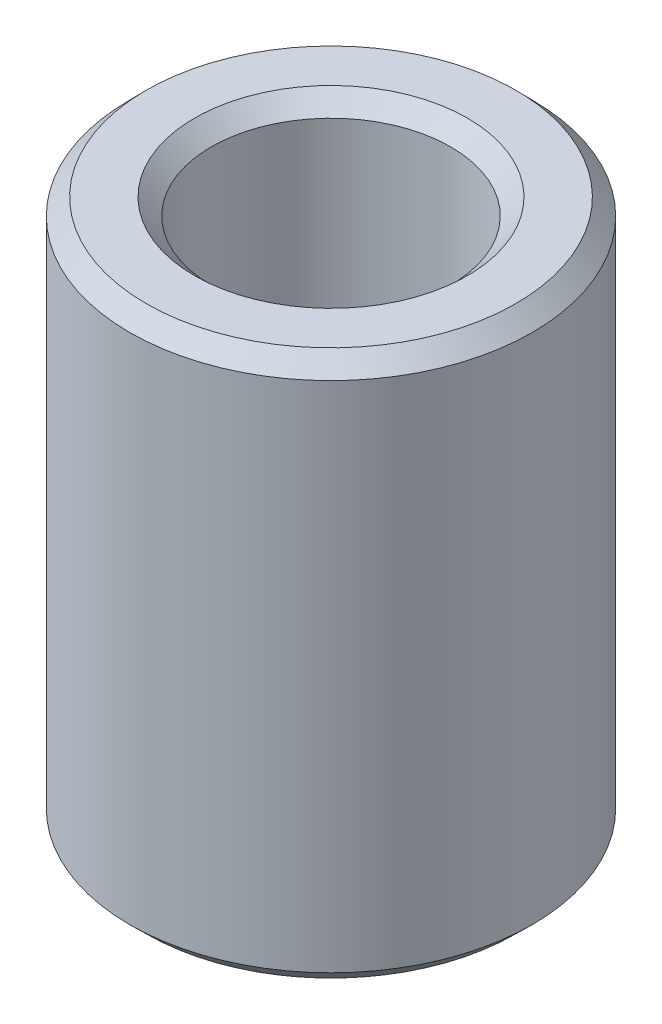
ISO-10303-21;
HEADER;
FILE_DESCRIPTION(('STEP AP214'),'2;1');
FILE_NAME('part.step','',(''),(''),'','','');
FILE_SCHEMA(('AUTOMOTIVE_DESIGN { 1 0 10303 214 1 1 1 1 }'));
ENDSEC;
DATA;
#1=APPLICATION_CONTEXT('core data for automotive mechanical design processes');
#2=APPLICATION_PROTOCOL_DEFINITION('international standard','automotive_design',2000,#1);
#3=PRODUCT_CONTEXT('',#1,'mechanical');
#4=PRODUCT('Part','Part','',(#3));
#5=PRODUCT_RELATED_PRODUCT_CATEGORY('part','',(#4));
#6=PRODUCT_DEFINITION_FORMATION('','',#4);
#7=PRODUCT_DEFINITION_CONTEXT('part definition',#1,'design');
#8=PRODUCT_DEFINITION('design','',#6,#7);
#9=PRODUCT_DEFINITION_SHAPE('','',#8);
#10=(LENGTH_UNIT() NAMED_UNIT(*) SI_UNIT(.MILLI.,.METRE.));
#11=(NAMED_UNIT(*) PLANE_ANGLE_UNIT() SI_UNIT($,.RADIAN.));
#12=(NAMED_UNIT(*) SI_UNIT($,.STERADIAN.) SOLID_ANGLE_UNIT());
#13=UNCERTAINTY_MEASURE_WITH_UNIT(LENGTH_MEASURE(1.E-05),#10,'distance_accuracy_value','');
#14=(GEOMETRIC_REPRESENTATION_CONTEXT(3) GLOBAL_UNCERTAINTY_ASSIGNED_CONTEXT((#13)) GLOBAL_UNIT_ASSIGNED_CONTEXT((#10,
#11,#12)) REPRESENTATION_CONTEXT('',''));
#15=CARTESIAN_POINT('',(0.,0.,0.));
#16=DIRECTION('',(0.,0.,1.));
#17=DIRECTION('',(1.,0.,0.));
#18=AXIS2_PLACEMENT_3D('',#15,#16,#17);
#19=CARTESIAN_POINT('',(0.,33.9073036419088,0.));
#20=DIRECTION('',(0.,-1.,0.));
#21=DIRECTION('',(0.,0.,-1.));
#22=AXIS2_PLACEMENT_3D('',#19,#20,#21);
#23=CYLINDRICAL_SURFACE('',#22,12.5);
#24=CARTESIAN_POINT('',(0.,1.02267454057475,0.));
#25=DIRECTION('',(0.,1.,0.));
#26=DIRECTION('',(0.,0.,1.));
#27=AXIS2_PLACEMENT_3D('',#24,#25,#26);
#28=CIRCLE('',#27,12.5);
#29=CARTESIAN_POINT('',(0.,1.02267454057475,12.5));
#30=VERTEX_POINT('',#29);
#31=EDGE_CURVE('E10',#30,#30,#28,.T.);
#32=ORIENTED_EDGE('',*,*,#31,.T.);
#33=EDGE_LOOP('',(#32));
#34=FACE_BOUND('',#33,.T.);
#35=CARTESIAN_POINT('',(0.,32.8659539406307,0.));
#36=DIRECTION('',(0.,1.,0.));
#37=DIRECTION('',(0.,0.,1.));
#38=AXIS2_PLACEMENT_3D('',#35,#36,#37);
#39=CIRCLE('',#38,12.5);
#40=CARTESIAN_POINT('',(0.,32.8659539406307,12.5));
#41=VERTEX_POINT('',#40);
#42=EDGE_CURVE('E50',#41,#41,#39,.F.);
#43=ORIENTED_EDGE('',*,*,#42,.T.);
#44=EDGE_LOOP('',(#43));
#45=FACE_BOUND('',#44,.T.);
#46=ADVANCED_FACE('F39',(#34,#45),#23,.T.);
#47=CARTESIAN_POINT('',(0.,33.9073036419088,0.));
#48=DIRECTION('',(0.,1.,0.));
#49=DIRECTION('',(0.,0.,1.));
#50=AXIS2_PLACEMENT_3D('',#47,#48,#49);
#51=PLANE('',#50);
#52=CARTESIAN_POINT('',(0.,33.9073036419088,0.));
#53=DIRECTION('',(0.,1.,0.));
#54=DIRECTION('',(0.,0.,1.));
#55=AXIS2_PLACEMENT_3D('',#52,#53,#54);
#56=CIRCLE('',#55,8.47496577175573);
#57=CARTESIAN_POINT('',(0.,33.9073036419088,8.47496577175573));
#58=VERTEX_POINT('',#57);
#59=EDGE_CURVE('E58',#58,#58,#56,.F.);
#60=ORIENTED_EDGE('',*,*,#59,.T.);
#61=EDGE_LOOP('',(#60));
#62=FACE_BOUND('',#61,.T.);
#63=CARTESIAN_POINT('',(0.,33.9073036419088,0.));
#64=DIRECTION('',(0.,1.,0.));
#65=DIRECTION('',(0.,0.,1.));
#66=AXIS2_PLACEMENT_3D('',#63,#64,#65);
#67=CIRCLE('',#66,11.4773254594253);
#68=CARTESIAN_POINT('',(0.,33.9073036419088,11.4773254594253));
#69=VERTEX_POINT('',#68);
#70=EDGE_CURVE('E61',#69,#69,#67,.T.);
#71=ORIENTED_EDGE('',*,*,#70,.T.);
#72=EDGE_LOOP('',(#71));
#73=FACE_BOUND('',#72,.T.);
#74=ADVANCED_FACE('F88',(#62,#73),#51,.T.);
#75=CARTESIAN_POINT('',(0.,0.,0.));
#76=DIRECTION('',(0.,1.,0.));
#77=DIRECTION('',(0.,0.,1.));
#78=AXIS2_PLACEMENT_3D('',#75,#76,#77);
#79=PLANE('',#78);
#80=CARTESIAN_POINT('',(0.,0.,0.));
#81=DIRECTION('',(0.,1.,0.));
#82=DIRECTION('',(0.,0.,1.));
#83=AXIS2_PLACEMENT_3D('',#80,#81,#82);
#84=CIRCLE('',#83,8.45629061105244);
#85=CARTESIAN_POINT('',(0.,0.,8.45629061105244));
#86=VERTEX_POINT('',#85);
#87=EDGE_CURVE('E51',#86,#86,#84,.T.);
#88=ORIENTED_EDGE('',*,*,#87,.T.);
#89=EDGE_LOOP('',(#88));
#90=FACE_BOUND('',#89,.T.);
#91=CARTESIAN_POINT('',(0.,0.,0.));
#92=DIRECTION('',(0.,1.,0.));
#93=DIRECTION('',(0.,0.,1.));
#94=AXIS2_PLACEMENT_3D('',#91,#92,#93);
#95=CIRCLE('',#94,11.458650298722);
#96=CARTESIAN_POINT('',(0.,0.,11.458650298722));
#97=VERTEX_POINT('',#96);
#98=EDGE_CURVE('E54',#97,#97,#95,.F.);
#99=ORIENTED_EDGE('',*,*,#98,.T.);
#100=EDGE_LOOP('',(#99));
#101=FACE_BOUND('',#100,.T.);
#102=ADVANCED_FACE('F83',(#90,#101),#79,.F.);
#103=CARTESIAN_POINT('',(0.,33.9073036419088,0.));
#104=DIRECTION('',(0.,-1.,0.));
#105=DIRECTION('',(0.,0.,-1.));
#106=AXIS2_PLACEMENT_3D('',#103,#104,#105);
#107=CYLINDRICAL_SURFACE('',#106,7.43361607047769);
#108=CARTESIAN_POINT('',(0.,32.884629101334,0.));
#109=DIRECTION('',(0.,1.,0.));
#110=DIRECTION('',(0.,0.,1.));
#111=AXIS2_PLACEMENT_3D('',#108,#109,#110);
#112=CIRCLE('',#111,7.43361607047769);
#113=CARTESIAN_POINT('',(0.,32.884629101334,7.43361607047769));
#114=VERTEX_POINT('',#113);
#115=EDGE_CURVE('E67',#114,#114,#112,.T.);
#116=ORIENTED_EDGE('',*,*,#115,.T.);
#117=EDGE_LOOP('',(#116));
#118=FACE_BOUND('',#117,.T.);
#119=CARTESIAN_POINT('',(0.,1.04134970127803,0.));
#120=DIRECTION('',(0.,1.,0.));
#121=DIRECTION('',(0.,0.,1.));
#122=AXIS2_PLACEMENT_3D('',#119,#120,#121);
#123=CIRCLE('',#122,7.43361607047769);
#124=CARTESIAN_POINT('',(0.,1.04134970127803,7.43361607047769));
#125=VERTEX_POINT('',#124);
#126=EDGE_CURVE('E69',#125,#125,#123,.F.);
#127=ORIENTED_EDGE('',*,*,#126,.T.);
#128=EDGE_LOOP('',(#127));
#129=FACE_BOUND('',#128,.T.);
#130=ADVANCED_FACE('F71',(#118,#129),#107,.F.);
#131=CARTESIAN_POINT('',(0.,32.884629101334,0.));
#132=DIRECTION('',(0.,1.,0.));
#133=DIRECTION('',(0.,0.,1.));
#134=AXIS2_PLACEMENT_3D('',#131,#132,#133);
#135=CONICAL_SURFACE('',#134,7.43361607047769,0.794445853213613);
#136=ORIENTED_EDGE('',*,*,#59,.F.);
#137=EDGE_LOOP('',(#136));
#138=FACE_BOUND('',#137,.T.);
#139=ORIENTED_EDGE('',*,*,#115,.F.);
#140=EDGE_LOOP('',(#139));
#141=FACE_BOUND('',#140,.T.);
#142=ADVANCED_FACE('F77',(#138,#141),#135,.F.);
#143=CARTESIAN_POINT('',(0.,0.,0.));
#144=DIRECTION('',(0.,-1.,0.));
#145=DIRECTION('',(0.,0.,-1.));
#146=AXIS2_PLACEMENT_3D('',#143,#144,#145);
#147=CONICAL_SURFACE('',#146,8.45629061105244,0.776350473581289);
#148=ORIENTED_EDGE('',*,*,#126,.F.);
#149=EDGE_LOOP('',(#148));
#150=FACE_BOUND('',#149,.T.);
#151=ORIENTED_EDGE('',*,*,#87,.F.);
#152=EDGE_LOOP('',(#151));
#153=FACE_BOUND('',#152,.T.);
#154=ADVANCED_FACE('F73',(#150,#153),#147,.F.);
#155=CARTESIAN_POINT('',(0.,1.02267454057475,0.));
#156=DIRECTION('',(0.,1.,0.));
#157=DIRECTION('',(0.,0.,1.));
#158=AXIS2_PLACEMENT_3D('',#155,#156,#157);
#159=CONICAL_SURFACE('',#158,12.5,0.794445853213612);
#160=ORIENTED_EDGE('',*,*,#98,.F.);
#161=EDGE_LOOP('',(#160));
#162=FACE_BOUND('',#161,.T.);
#163=ORIENTED_EDGE('',*,*,#31,.F.);
#164=EDGE_LOOP('',(#163));
#165=FACE_BOUND('',#164,.T.);
#166=ADVANCED_FACE('F76',(#162,#165),#159,.T.);
#167=CARTESIAN_POINT('',(0.,33.9073036419088,0.));
#168=DIRECTION('',(0.,-1.,0.));
#169=DIRECTION('',(0.,0.,-1.));
#170=AXIS2_PLACEMENT_3D('',#167,#168,#169);
#171=CONICAL_SURFACE('',#170,11.4773254594253,0.776350473581286);
#172=ORIENTED_EDGE('',*,*,#42,.F.);
#173=EDGE_LOOP('',(#172));
#174=FACE_BOUND('',#173,.T.);
#175=ORIENTED_EDGE('',*,*,#70,.F.);
#176=EDGE_LOOP('',(#175));
#177=FACE_BOUND('',#176,.T.);
#178=ADVANCED_FACE('F45',(#174,#177),#171,.T.);
#179=CLOSED_SHELL('',(#46,#74,#102,#130,#142,#154,#166,#178));
#180=MANIFOLD_SOLID_BREP('B2',#179);
#181=ADVANCED_BREP_SHAPE_REPRESENTATION('',(#18,#180),#14);
#182=SHAPE_DEFINITION_REPRESENTATION(#9,#181);
ENDSEC;
END-ISO-10303-21;
